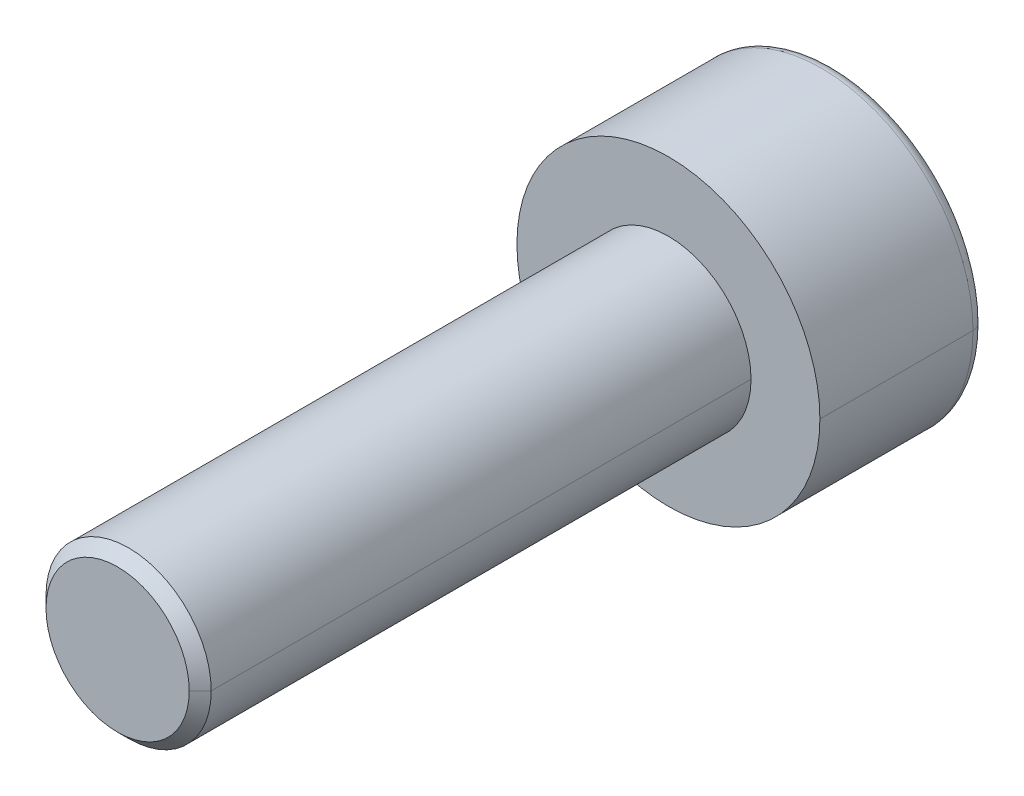
ISO-10303-21;
HEADER;
FILE_DESCRIPTION(('STEP AP214'),'2;1');
FILE_NAME('part.step','',(''),(''),'','','');
FILE_SCHEMA(('AUTOMOTIVE_DESIGN { 1 0 10303 214 1 1 1 1 }'));
ENDSEC;
DATA;
#1=APPLICATION_CONTEXT('core data for automotive mechanical design processes');
#2=APPLICATION_PROTOCOL_DEFINITION('international standard','automotive_design',2000,#1);
#3=PRODUCT_CONTEXT('',#1,'mechanical');
#4=PRODUCT('Part','Part','',(#3));
#5=PRODUCT_RELATED_PRODUCT_CATEGORY('part','',(#4));
#6=PRODUCT_DEFINITION_FORMATION('','',#4);
#7=PRODUCT_DEFINITION_CONTEXT('part definition',#1,'design');
#8=PRODUCT_DEFINITION('design','',#6,#7);
#9=PRODUCT_DEFINITION_SHAPE('','',#8);
#10=(LENGTH_UNIT() NAMED_UNIT(*) SI_UNIT(.MILLI.,.METRE.));
#11=(NAMED_UNIT(*) PLANE_ANGLE_UNIT() SI_UNIT($,.RADIAN.));
#12=(NAMED_UNIT(*) SI_UNIT($,.STERADIAN.) SOLID_ANGLE_UNIT());
#13=UNCERTAINTY_MEASURE_WITH_UNIT(LENGTH_MEASURE(1.E-05),#10,'distance_accuracy_value','');
#14=(GEOMETRIC_REPRESENTATION_CONTEXT(3) GLOBAL_UNCERTAINTY_ASSIGNED_CONTEXT((#13)) GLOBAL_UNIT_ASSIGNED_CONTEXT((#10,
#11,#12)) REPRESENTATION_CONTEXT('',''));
#15=CARTESIAN_POINT('',(0.,0.,0.));
#16=DIRECTION('',(0.,0.,1.));
#17=DIRECTION('',(1.,0.,0.));
#18=AXIS2_PLACEMENT_3D('',#15,#16,#17);
#19=CARTESIAN_POINT('',(0.,0.,-2.78));
#20=DIRECTION('',(0.,0.,-1.));
#21=DIRECTION('',(-1.,0.,0.));
#22=AXIS2_PLACEMENT_3D('',#19,#20,#21);
#23=TOROIDAL_SURFACE('',#22,2.53,0.22);
#24=CARTESIAN_POINT('',(2.53,0.,-2.78));
#25=DIRECTION('',(0.,1.,0.));
#26=DIRECTION('',(-1.,0.,0.));
#27=AXIS2_PLACEMENT_3D('',#24,#25,#26);
#28=CIRCLE('',#27,0.22);
#29=CARTESIAN_POINT('',(2.75,0.,-2.78));
#30=VERTEX_POINT('',#29);
#31=CARTESIAN_POINT('',(2.53,0.,-3.));
#32=VERTEX_POINT('',#31);
#33=EDGE_CURVE('E347',#30,#32,#28,.T.);
#34=ORIENTED_EDGE('',*,*,#33,.F.);
#35=CARTESIAN_POINT('',(0.,0.,-2.78));
#36=DIRECTION('',(0.,0.,1.));
#37=DIRECTION('',(-1.,0.,0.));
#38=AXIS2_PLACEMENT_3D('',#35,#36,#37);
#39=CIRCLE('',#38,2.75);
#40=CARTESIAN_POINT('',(-2.75,0.,-2.78));
#41=VERTEX_POINT('',#40);
#42=EDGE_CURVE('E338',#41,#30,#39,.T.);
#43=ORIENTED_EDGE('',*,*,#42,.F.);
#44=CARTESIAN_POINT('',(-2.53,0.,-2.78));
#45=DIRECTION('',(0.,-1.,0.));
#46=DIRECTION('',(0.,0.,-1.));
#47=AXIS2_PLACEMENT_3D('',#44,#45,#46);
#48=CIRCLE('',#47,0.22);
#49=CARTESIAN_POINT('',(-2.53,0.,-3.));
#50=VERTEX_POINT('',#49);
#51=EDGE_CURVE('E283',#41,#50,#48,.T.);
#52=ORIENTED_EDGE('',*,*,#51,.T.);
#53=CARTESIAN_POINT('',(0.,0.,-3.));
#54=DIRECTION('',(0.,0.,-1.));
#55=DIRECTION('',(-1.,0.,0.));
#56=AXIS2_PLACEMENT_3D('',#53,#54,#55);
#57=CIRCLE('',#56,2.53);
#58=EDGE_CURVE('E337',#32,#50,#57,.T.);
#59=ORIENTED_EDGE('',*,*,#58,.F.);
#60=EDGE_LOOP('',(#34,#43,#52,#59));
#61=FACE_BOUND('',#60,.T.);
#62=ADVANCED_FACE('F14',(#61),#23,.T.);
#63=CARTESIAN_POINT('',(-0.721687836487031,-1.25,10.001));
#64=DIRECTION('',(-0.866025403784438,-0.5,0.));
#65=DIRECTION('',(-0.5,0.866025403784438,0.));
#66=AXIS2_PLACEMENT_3D('',#63,#64,#65);
#67=PLANE('',#66);
#68=DIRECTION('',(0.,0.,-1.));
#69=VECTOR('',#68,1.);
#70=CARTESIAN_POINT('',(-0.721687836487031,-1.25,10.001));
#71=LINE('',#70,#69);
#72=CARTESIAN_POINT('',(-0.721687836487032,-1.25,-1.02534578182651));
#73=VERTEX_POINT('',#72);
#74=CARTESIAN_POINT('',(-0.721687836487031,-1.25,-3.));
#75=VERTEX_POINT('',#74);
#76=EDGE_CURVE('E9',#73,#75,#71,.T.);
#77=ORIENTED_EDGE('',*,*,#76,.T.);
#78=DIRECTION('',(-0.5,0.866025403784438,0.));
#79=VECTOR('',#78,1.);
#80=CARTESIAN_POINT('',(-0.721687836487031,-1.25,-3.));
#81=LINE('',#80,#79);
#82=CARTESIAN_POINT('',(-1.44337567297406,0.,-3.));
#83=VERTEX_POINT('',#82);
#84=EDGE_CURVE('E383',#75,#83,#81,.T.);
#85=ORIENTED_EDGE('',*,*,#84,.T.);
#86=DIRECTION('',(0.,0.,-1.));
#87=VECTOR('',#86,1.);
#88=CARTESIAN_POINT('',(-1.44337567297406,0.,10.001));
#89=LINE('',#88,#87);
#90=CARTESIAN_POINT('',(-1.44337567297406,0.,-1.02534578182651));
#91=VERTEX_POINT('',#90);
#92=EDGE_CURVE('E247',#91,#83,#89,.T.);
#93=ORIENTED_EDGE('',*,*,#92,.F.);
#94=CARTESIAN_POINT('',(-0.721687836488628,-1.25000000000276,-1.02534578182689));
#95=CARTESIAN_POINT('',(-0.737028905717831,-1.22342490729214,-1.01976117551291));
#96=CARTESIAN_POINT('',(-0.752392752544005,-1.19680749133607,-1.01443399416995));
#97=CARTESIAN_POINT('',(-0.78285146701696,-1.14404697766101,-1.00445997520597));
#98=CARTESIAN_POINT('',(-0.797945293580644,-1.11790551079034,-0.999801305045797));
#99=CARTESIAN_POINT('',(-0.827945381944215,-1.06596855728888,-0.991162467800491));
#100=CARTESIAN_POINT('',(-0.842850800425723,-1.04017419454268,-0.987172672666928));
#101=CARTESIAN_POINT('',(-0.87255671333803,-0.988781421927034,-0.979871222238988));
#102=CARTESIAN_POINT('',(-0.887356747658947,-0.963183663124447,-0.976553126739032));
#103=CARTESIAN_POINT('',(-0.917338190824219,-0.911236027906067,-0.97049521527339));
#104=CARTESIAN_POINT('',(-0.932519435239611,-0.884884013008228,-0.96777282238088));
#105=CARTESIAN_POINT('',(-0.962675714506317,-0.832539602040717,-0.963116776274453));
#106=CARTESIAN_POINT('',(-0.977650288499953,-0.806547979920624,-0.961171525572048));
#107=CARTESIAN_POINT('',(-1.00756607844125,-0.754698728350948,-0.958065927560992));
#108=CARTESIAN_POINT('',(-1.02250698803559,-0.728841191436054,-0.956901114579908));
#109=CARTESIAN_POINT('',(-1.05248357900316,-0.676993641155056,-0.955347814141439));
#110=CARTESIAN_POINT('',(-1.06751937330052,-0.651003582266423,-0.954963042805446));
#111=CARTESIAN_POINT('',(-1.09753796830446,-0.599007101351835,-0.954962542963305));
#112=CARTESIAN_POINT('',(-1.11252078824552,-0.5730006904358,-0.955346498559583));
#113=CARTESIAN_POINT('',(-1.1424254792955,-0.521130795636728,-0.956898723534234));
#114=CARTESIAN_POINT('',(-1.15734732390822,-0.495267191970626,-0.958063484033838));
#115=CARTESIAN_POINT('',(-1.18729435937359,-0.443436273258131,-0.961169177891923));
#116=CARTESIAN_POINT('',(-1.20231962659409,-0.417469284730215,-0.963114790934926));
#117=CARTESIAN_POINT('',(-1.23258152712783,-0.365166667551945,-0.967771543521245));
#118=CARTESIAN_POINT('',(-1.24781767835746,-0.338831818188706,-0.970494478844874));
#119=CARTESIAN_POINT('',(-1.27781558991929,-0.286886130729855,-0.976551997911192));
#120=CARTESIAN_POINT('',(-1.29257934454839,-0.26127435230088,-0.979868743297719));
#121=CARTESIAN_POINT('',(-1.32222852737226,-0.209858358317596,-0.987168466783736));
#122=CARTESIAN_POINT('',(-1.33711363698706,-0.184054887973093,-0.991157973283988));
#123=CARTESIAN_POINT('',(-1.36709323803795,-0.132106531907231,-0.999796871485574));
#124=CARTESIAN_POINT('',(-1.38218717849781,-0.105962953278782,-1.00445597673786));
#125=CARTESIAN_POINT('',(-1.41265514296032,-0.0531982255226708,-1.01443158402468));
#126=CARTESIAN_POINT('',(-1.42802826355574,-0.026578802412704,-1.01976000156966));
#127=CARTESIAN_POINT('',(-1.44337567297725,0.,-1.02534578182689));
#128=B_SPLINE_CURVE_WITH_KNOTS('',3,(#94,#95,#96,#97,#98,#99,#100,#101,#102,#103,#104,#105,#106,
#107,#108,#109,#110,#111,#112,#113,#114,#115,#116,#117,#118,#119,#120,#121,#122,#123,#124,#125,
#126,#127),.UNSPECIFIED.,.F.,.F.,(4,2,2,2,2,2,2,2,2,2,2,2,2,2,2,2,4),(0.,0.0935684862814182,
0.185193573801132,0.275358779576021,0.364613619727227,0.456206281143289,0.546375864607568,
0.636024987109074,0.726100204133781,0.81613841360598,0.905774686698935,0.995956373048592,
1.08758679344144,1.17682329674904,1.26698163449864,1.35861251377136,1.45220047471258),.UNSPECIFIED.);
#129=EDGE_CURVE('E149',#73,#91,#128,.T.);
#130=ORIENTED_EDGE('',*,*,#129,.F.);
#131=EDGE_LOOP('',(#77,#85,#93,#130));
#132=FACE_BOUND('',#131,.T.);
#133=ADVANCED_FACE('F198',(#132),#67,.F.);
#134=CARTESIAN_POINT('',(0.721687836487035,-1.25,10.001));
#135=DIRECTION('',(0.,-1.,0.));
#136=DIRECTION('',(0.,0.,-1.));
#137=AXIS2_PLACEMENT_3D('',#134,#135,#136);
#138=PLANE('',#137);
#139=DIRECTION('',(0.,0.,-1.));
#140=VECTOR('',#139,1.);
#141=CARTESIAN_POINT('',(0.721687836487035,-1.25,10.001));
#142=LINE('',#141,#140);
#143=CARTESIAN_POINT('',(0.721687836487035,-1.25,-1.02534578182651));
#144=VERTEX_POINT('',#143);
#145=CARTESIAN_POINT('',(0.721687836487035,-1.25,-3.));
#146=VERTEX_POINT('',#145);
#147=EDGE_CURVE('E28',#144,#146,#142,.T.);
#148=ORIENTED_EDGE('',*,*,#147,.T.);
#149=DIRECTION('',(-1.,0.,0.));
#150=VECTOR('',#149,1.);
#151=CARTESIAN_POINT('',(0.721687836487035,-1.25,-3.));
#152=LINE('',#151,#150);
#153=EDGE_CURVE('E388',#146,#75,#152,.T.);
#154=ORIENTED_EDGE('',*,*,#153,.T.);
#155=ORIENTED_EDGE('',*,*,#76,.F.);
#156=CARTESIAN_POINT('',(0.721687836488629,-1.25000000000276,-1.02534578182689));
#157=CARTESIAN_POINT('',(0.69106989522446,-1.24999821848567,-1.01977342261906));
#158=CARTESIAN_POINT('',(0.660404115850802,-1.24999523746448,-1.0144574364315));
#159=CARTESIAN_POINT('',(0.599614483094639,-1.24999366118821,-1.00450263885457));
#160=CARTESIAN_POINT('',(0.569492547467017,-1.24999497645064,-0.999852090531638));
#161=CARTESIAN_POINT('',(0.509639876543751,-1.25000804939325,-0.991226340753921));
#162=CARTESIAN_POINT('',(0.479910526091015,-1.25001964089534,-0.987241586492229));
#163=CARTESIAN_POINT('',(0.420673075610606,-1.2500497394438,-0.979947087981634));
#164=CARTESIAN_POINT('',(0.391165765094276,-1.25006817562219,-0.976630946044779));
#165=CARTESIAN_POINT('',(0.331241061966962,-1.25005916633512,-0.970566724830018));
#166=CARTESIAN_POINT('',(0.300821743064696,-1.2500303956143,-0.967837571691795));
#167=CARTESIAN_POINT('',(0.240399134076878,-1.24997380174712,-0.96316817933803));
#168=CARTESIAN_POINT('',(0.210396749868581,-1.24994597082088,-0.961216306373586));
#169=CARTESIAN_POINT('',(0.150526231254389,-1.24992842873486,-0.958097675193508));
#170=CARTESIAN_POINT('',(0.120658333381504,-1.24993849637725,-0.956926408006522));
#171=CARTESIAN_POINT('',(0.0607619538122846,-1.24997451013093,-0.95536034405441));
#172=CARTESIAN_POINT('',(0.0307333766028099,-1.25000053057617,-0.954969218958641));
#173=CARTESIAN_POINT('',(-0.0293692943147514,-1.2499994686253,-0.954956501715708));
#174=CARTESIAN_POINT('',(-0.0594433882894818,-1.24997230599032,-0.955336072371663));
#175=CARTESIAN_POINT('',(-0.119440155388413,-1.24993787968559,-0.956883291936376));
#176=CARTESIAN_POINT('',(-0.149362916869912,-1.24993052974767,-0.958047496601141));
#177=CARTESIAN_POINT('',(-0.209354932788893,-1.24995374775689,-0.961155699010819));
#178=CARTESIAN_POINT('',(-0.239423935435349,-1.2499845527295,-0.96310451998429));
#179=CARTESIAN_POINT('',(-0.299993961178023,-1.25004381840903,-0.967771201974227));
#180=CARTESIAN_POINT('',(-0.330494052906279,-1.25007223281607,-0.970501060282251));
#181=CARTESIAN_POINT('',(-0.390552271687982,-1.25007803265856,-0.976567284934808));
#182=CARTESIAN_POINT('',(-0.420112387925057,-1.25005685447466,-0.979884069240934));
#183=CARTESIAN_POINT('',(-0.479456429693424,-1.25002300837156,-0.987183082409129));
#184=CARTESIAN_POINT('',(-0.509239560811057,-1.25001042950366,-0.991171756617251));
#185=CARTESIAN_POINT('',(-0.569202101243196,-1.24999590387905,-0.999808168376348));
#186=CARTESIAN_POINT('',(-0.599380115468247,-1.24999413263484,-1.00446553457865));
#187=CARTESIAN_POINT('',(-0.660285332538211,-1.24999519744416,-1.0144368360125));
#188=CARTESIAN_POINT('',(-0.691010602252978,-1.24999813204998,-1.01976260529068));
#189=CARTESIAN_POINT('',(-0.721687836488628,-1.25000000000276,-1.02534578182689));
#190=B_SPLINE_CURVE_WITH_KNOTS('',3,(#156,#157,#158,#159,#160,#161,#162,#163,#164,#165,#166,
#167,#168,#169,#170,#171,#172,#173,#174,#175,#176,#177,#178,#179,#180,#181,#182,#183,#184,#185,
#186,#187,#188,#189),.UNSPECIFIED.,.F.,.F.,(4,2,2,2,2,2,2,2,2,2,2,2,2,2,2,2,4),(0.,
0.0933632628440702,0.184794465323455,0.274773558726806,0.363845895339632,0.455461829878775,
0.545649745829167,0.635312091665749,0.725395438931119,0.815614802298437,0.905440694405152,
0.995827411260518,1.08768483376141,1.17691477341478,1.26705528982293,1.35865584660163,
1.45219992963325),.UNSPECIFIED.);
#191=EDGE_CURVE('E141',#144,#73,#190,.T.);
#192=ORIENTED_EDGE('',*,*,#191,.F.);
#193=EDGE_LOOP('',(#148,#154,#155,#192));
#194=FACE_BOUND('',#193,.T.);
#195=ADVANCED_FACE('F143',(#194),#138,.F.);
#196=CARTESIAN_POINT('',(1.44337567297407,0.,10.001));
#197=DIRECTION('',(0.866025403784439,-0.5,0.));
#198=DIRECTION('',(0.,0.,-1.));
#199=AXIS2_PLACEMENT_3D('',#196,#197,#198);
#200=PLANE('',#199);
#201=DIRECTION('',(0.,0.,-1.));
#202=VECTOR('',#201,1.);
#203=CARTESIAN_POINT('',(1.44337567297407,0.,10.001));
#204=LINE('',#203,#202);
#205=CARTESIAN_POINT('',(1.44337567297407,0.,-1.02534578182651));
#206=VERTEX_POINT('',#205);
#207=CARTESIAN_POINT('',(1.44337567297407,0.,-3.));
#208=VERTEX_POINT('',#207);
#209=EDGE_CURVE('E138',#206,#208,#204,.T.);
#210=ORIENTED_EDGE('',*,*,#209,.T.);
#211=DIRECTION('',(-0.5,-0.866025403784439,0.));
#212=VECTOR('',#211,1.);
#213=CARTESIAN_POINT('',(1.44337567297407,0.,-3.));
#214=LINE('',#213,#212);
#215=EDGE_CURVE('E133',#208,#146,#214,.T.);
#216=ORIENTED_EDGE('',*,*,#215,.T.);
#217=ORIENTED_EDGE('',*,*,#147,.F.);
#218=CARTESIAN_POINT('',(1.44337567297725,0.,-1.02534578182689));
#219=CARTESIAN_POINT('',(1.42803150219652,-0.026573302028887,-1.01976117551291));
#220=CARTESIAN_POINT('',(1.41266206720855,-0.0531874916581321,-1.01443399416994));
#221=CARTESIAN_POINT('',(1.38219947928574,-0.105945768995711,-1.00445997520596));
#222=CARTESIAN_POINT('',(1.36710721816541,-0.132088139675484,-0.999801305045794));
#223=CARTESIAN_POINT('',(1.33712854121977,-0.184037455064854,-0.991162467800485));
#224=CARTESIAN_POINT('',(1.32224267704788,-0.209843107497014,-0.98717267266692));
#225=CARTESIAN_POINT('',(1.29258818684797,-0.261265569029666,-0.979871222238987));
#226=CARTESIAN_POINT('',(1.27781989460544,-0.286881654129879,-0.976553126739042));
#227=CARTESIAN_POINT('',(1.24782264442245,-0.338820163162294,-0.970495215273404));
#228=CARTESIAN_POINT('',(1.23259175228773,-0.365143513935858,-0.967772822380881));
#229=CARTESIAN_POINT('',(1.20233830227713,-0.417431823348022,-0.963116776274445));
#230=CARTESIAN_POINT('',(1.18731618423242,-0.443395995897376,-0.961171525572044));
#231=CARTESIAN_POINT('',(1.15737131017654,-0.49522845574567,-0.958065927560991));
#232=CARTESIAN_POINT('',(1.14244848112612,-0.52109643146751,-0.956901114579908));
#233=CARTESIAN_POINT('',(1.1125354809425,-0.572980695904942,-0.955347814141437));
#234=CARTESIAN_POINT('',(1.09754532684772,-0.598997105176963,-0.954963042805445));
#235=CARTESIAN_POINT('',(1.0675243509702,-0.650992211493703,-0.954962542963307));
#236=CARTESIAN_POINT('',(1.05249354842619,-0.676970919641005,-0.955346498559583));
#237=CARTESIAN_POINT('',(1.02252524736355,-0.728804089182149,-0.956898723534234));
#238=CARTESIAN_POINT('',(1.00758763186166,-0.754658587521139,-0.958063484033838));
#239=CARTESIAN_POINT('',(0.977674257287833,-0.80650894035843,-0.961169177891923));
#240=CARTESIAN_POINT('',(0.962698819173131,-0.832504697733997,-0.963114790934926));
#241=CARTESIAN_POINT('',(0.932534374279204,-0.884863580952144,-0.967771543521244));
#242=CARTESIAN_POINT('',(0.917345801340618,-0.911225899654526,-0.970494478844874));
#243=CARTESIAN_POINT('',(0.887358472165125,-0.963177696856981,-0.976551997911192));
#244=CARTESIAN_POINT('',(0.872559898724083,-0.988769372635505,-0.979868743297719));
#245=CARTESIAN_POINT('',(0.842856933185666,-1.04015431515407,-0.987168466783736));
#246=CARTESIAN_POINT('',(0.827953027168927,-1.06594693339085,-0.991157973283987));
#247=CARTESIAN_POINT('',(0.7979542316565,-1.11788420752918,-0.999796871485574));
#248=CARTESIAN_POINT('',(0.782860198648357,-1.14402773272485,-1.00445597673786));
#249=CARTESIAN_POINT('',(0.752398586219049,-1.19679612782903,-1.01443158402468));
#250=CARTESIAN_POINT('',(0.737032049869443,-1.22341935235509,-1.01976000156966));
#251=CARTESIAN_POINT('',(0.721687836488629,-1.25000000000276,-1.02534578182689));
#252=B_SPLINE_CURVE_WITH_KNOTS('',3,(#218,#219,#220,#221,#222,#223,#224,#225,#226,#227,#228,
#229,#230,#231,#232,#233,#234,#235,#236,#237,#238,#239,#240,#241,#242,#243,#244,#245,#246,#247,
#248,#249,#250,#251),.UNSPECIFIED.,.F.,.F.,(4,2,2,2,2,2,2,2,2,2,2,2,2,2,2,2,4),(0.,
0.0935684862811158,0.185193573800729,0.275358779575722,0.364613619727235,0.456206281142907,
0.546375864607052,0.636024987108686,0.726100204133779,0.816138413605981,0.905774686698939,
0.995956373048596,1.08758679344144,1.17682329674905,1.26698163449864,1.35861251377136,
1.45220047471258),.UNSPECIFIED.);
#253=EDGE_CURVE('E130',#206,#144,#252,.T.);
#254=ORIENTED_EDGE('',*,*,#253,.F.);
#255=EDGE_LOOP('',(#210,#216,#217,#254));
#256=FACE_BOUND('',#255,.T.);
#257=ADVANCED_FACE('F128',(#256),#200,.F.);
#258=CARTESIAN_POINT('',(0.721687836487032,1.25,10.001));
#259=DIRECTION('',(0.866025403784439,0.5,0.));
#260=DIRECTION('',(0.,0.,-1.));
#261=AXIS2_PLACEMENT_3D('',#258,#259,#260);
#262=PLANE('',#261);
#263=DIRECTION('',(0.,0.,-1.));
#264=VECTOR('',#263,1.);
#265=CARTESIAN_POINT('',(0.721687836487032,1.25,10.001));
#266=LINE('',#265,#264);
#267=CARTESIAN_POINT('',(0.721687836487032,1.25,-1.02534578182651));
#268=VERTEX_POINT('',#267);
#269=CARTESIAN_POINT('',(0.721687836487032,1.25,-3.));
#270=VERTEX_POINT('',#269);
#271=EDGE_CURVE('E43',#268,#270,#266,.T.);
#272=ORIENTED_EDGE('',*,*,#271,.T.);
#273=DIRECTION('',(0.5,-0.866025403784438,0.));
#274=VECTOR('',#273,1.);
#275=CARTESIAN_POINT('',(0.721687836487032,1.25,-3.));
#276=LINE('',#275,#274);
#277=EDGE_CURVE('E321',#270,#208,#276,.T.);
#278=ORIENTED_EDGE('',*,*,#277,.T.);
#279=ORIENTED_EDGE('',*,*,#209,.F.);
#280=CARTESIAN_POINT('',(0.721687836488626,1.25000000000276,-1.02534578182689));
#281=CARTESIAN_POINT('',(0.737028905717706,1.22342490729219,-1.01976117551291));
#282=CARTESIAN_POINT('',(0.752392752543788,1.19680749133618,-1.01443399416994));
#283=CARTESIAN_POINT('',(0.782851467016631,1.14404697766122,-1.00445997520596));
#284=CARTESIAN_POINT('',(0.797945293580297,1.11790551079058,-0.999801305045794));
#285=CARTESIAN_POINT('',(0.827945381943881,1.06596855728912,-0.991162467800485));
#286=CARTESIAN_POINT('',(0.842850800425421,1.0401741945429,-0.98717267266692));
#287=CARTESIAN_POINT('',(0.872556713337869,0.988781421927176,-0.979871222238987));
#288=CARTESIAN_POINT('',(0.887356747658896,0.963183663124531,-0.976553126739042));
#289=CARTESIAN_POINT('',(0.91733819082416,0.911236027906178,-0.970495215273404));
#290=CARTESIAN_POINT('',(0.932519435239431,0.88488401300842,-0.967772822380881));
#291=CARTESIAN_POINT('',(0.962675714506009,0.832539602041038,-0.963116776274445));
#292=CARTESIAN_POINT('',(0.977650288499635,0.80654797992099,-0.961171525572044));
#293=CARTESIAN_POINT('',(1.00756607844096,0.754698728351331,-0.958065927560992));
#294=CARTESIAN_POINT('',(1.02250698803534,0.72884119143641,-0.956901114579908));
#295=CARTESIAN_POINT('',(1.05248357900302,0.676993641155274,-0.955347814141437));
#296=CARTESIAN_POINT('',(1.06751937330045,0.651003582266533,-0.954963042805444));
#297=CARTESIAN_POINT('',(1.0975379683044,0.599007101351953,-0.954962542963308));
#298=CARTESIAN_POINT('',(1.1125207882454,0.573000690436034,-0.955346498559585));
#299=CARTESIAN_POINT('',(1.14242547929532,0.521130795637124,-0.956898723534234));
#300=CARTESIAN_POINT('',(1.15734732390803,0.495267191971068,-0.958063484033838));
#301=CARTESIAN_POINT('',(1.18729435937343,0.443436273258589,-0.961169177891927));
#302=CARTESIAN_POINT('',(1.20231962659397,0.417469284730643,-0.963114790934934));
#303=CARTESIAN_POINT('',(1.23258152712775,0.365166667552197,-0.967771543521243));
#304=CARTESIAN_POINT('',(1.24781767835739,0.338831818188813,-0.970494478844861));
#305=CARTESIAN_POINT('',(1.27781558991925,0.286886130729941,-0.976551997911182));
#306=CARTESIAN_POINT('',(1.29257934454835,0.261274352301088,-0.97986874329772));
#307=CARTESIAN_POINT('',(1.32222852737222,0.209858358317966,-0.987168466783744));
#308=CARTESIAN_POINT('',(1.33711363698702,0.184054887973501,-0.991157973283993));
#309=CARTESIAN_POINT('',(1.36709323803793,0.132106531907646,-0.999796871485578));
#310=CARTESIAN_POINT('',(1.3821871784978,0.105962953279166,-1.00445597673787));
#311=CARTESIAN_POINT('',(1.41265514296033,0.0531982255229139,-1.01443158402469));
#312=CARTESIAN_POINT('',(1.42802826355576,0.0265788024128361,-1.01976000156966));
#313=CARTESIAN_POINT('',(1.44337567297725,0.,-1.02534578182689));
#314=B_SPLINE_CURVE_WITH_KNOTS('',3,(#280,#281,#282,#283,#284,#285,#286,#287,#288,#289,#290,
#291,#292,#293,#294,#295,#296,#297,#298,#299,#300,#301,#302,#303,#304,#305,#306,#307,#308,#309,
#310,#311,#312,#313),.UNSPECIFIED.,.F.,.F.,(4,2,2,2,2,2,2,2,2,2,2,2,2,2,2,2,4),(0.,
0.0935684862811152,0.18519357380073,0.275358779575722,0.364613619727236,0.456206281142908,
0.546375864607054,0.63602498710869,0.726100204133785,0.816138413605596,0.905774686698423,
0.995956373048211,1.08758679344145,1.17682329674875,1.26698163449824,1.35861251377106,
1.45220047471258),.UNSPECIFIED.);
#315=EDGE_CURVE('E277',#268,#206,#314,.T.);
#316=ORIENTED_EDGE('',*,*,#315,.F.);
#317=EDGE_LOOP('',(#272,#278,#279,#316));
#318=FACE_BOUND('',#317,.T.);
#319=ADVANCED_FACE('F209',(#318),#262,.F.);
#320=CARTESIAN_POINT('',(-0.721687836487032,1.25,10.001));
#321=DIRECTION('',(0.,1.,0.));
#322=DIRECTION('',(1.,0.,0.));
#323=AXIS2_PLACEMENT_3D('',#320,#321,#322);
#324=PLANE('',#323);
#325=DIRECTION('',(0.,0.,-1.));
#326=VECTOR('',#325,1.);
#327=CARTESIAN_POINT('',(-0.721687836487032,1.25,10.001));
#328=LINE('',#327,#326);
#329=CARTESIAN_POINT('',(-0.721687836487032,1.25,-1.02534578182651));
#330=VERTEX_POINT('',#329);
#331=CARTESIAN_POINT('',(-0.721687836487032,1.25,-3.));
#332=VERTEX_POINT('',#331);
#333=EDGE_CURVE('E238',#330,#332,#328,.T.);
#334=ORIENTED_EDGE('',*,*,#333,.T.);
#335=DIRECTION('',(1.,0.,0.));
#336=VECTOR('',#335,1.);
#337=CARTESIAN_POINT('',(-0.721687836487032,1.25,-3.));
#338=LINE('',#337,#336);
#339=EDGE_CURVE('E315',#332,#270,#338,.T.);
#340=ORIENTED_EDGE('',*,*,#339,.T.);
#341=ORIENTED_EDGE('',*,*,#271,.F.);
#342=CARTESIAN_POINT('',(-0.721687836488627,1.25000000000276,-1.02534578182689));
#343=CARTESIAN_POINT('',(-0.691017018601996,1.24999818698242,-1.01976378543812));
#344=CARTESIAN_POINT('',(-0.660298157594406,1.2499958302246,-1.01443925883621));
#345=CARTESIAN_POINT('',(-0.599401258719088,1.2499962033096,-1.00446955406069));
#346=CARTESIAN_POINT('',(-0.569225140327368,1.2499988291996,-0.999812625256782));
#347=CARTESIAN_POINT('',(-0.50926222938833,1.25001464102119,-0.991176274700509));
#348=CARTESIAN_POINT('',(-0.479476819379824,1.25002765943499,-0.987187310214842));
#349=CARTESIAN_POINT('',(-0.420124479236322,1.25006013698098,-0.979886561271186));
#350=CARTESIAN_POINT('',(-0.390558332708806,1.25007953058455,-0.976568419996489));
#351=CARTESIAN_POINT('',(-0.330506688883164,1.25007069355756,-0.970501798660996));
#352=CARTESIAN_POINT('',(-0.300019244295399,1.25004107484861,-0.967772483513778));
#353=CARTESIAN_POINT('',(-0.239465913128966,1.24998197389594,-0.963106509003777));
#354=CARTESIAN_POINT('',(-0.209400942601997,1.24995249683952,-0.961158051806058));
#355=CARTESIAN_POINT('',(-0.149408671403001,1.2499319393902,-0.958049945837115));
#356=CARTESIAN_POINT('',(-0.119481611177984,1.2499406324116,-0.956885689357264));
#357=CARTESIAN_POINT('',(-0.0594681667187558,1.24997504904478,-0.955337390925111));
#358=CARTESIAN_POINT('',(-0.0293816887161701,1.25000085165947,-0.954957002080744));
#359=CARTESIAN_POINT('',(0.0307209998153106,1.24999915032776,-0.954968714524349));
#360=CARTESIAN_POINT('',(0.060737210707922,1.24997177046308,-0.955359017721788));
#361=CARTESIAN_POINT('',(0.12061693597785,1.24993574279334,-0.956923998252151));
#362=CARTESIAN_POINT('',(0.150480540408343,1.24992701298175,-0.958095211859228));
#363=CARTESIAN_POINT('',(0.210350803002745,1.2499472067504,-0.96121393927303));
#364=CARTESIAN_POINT('',(0.240357213275473,1.24997636191827,-0.963166176754469));
#365=CARTESIAN_POINT('',(0.300796493823954,1.25003312337082,-0.967836282271108));
#366=CARTESIAN_POINT('',(0.331228442901647,1.2500606971186,-0.970565982940798));
#367=CARTESIAN_POINT('',(0.391159720329838,1.25006668550964,-0.976629814383589));
#368=CARTESIAN_POINT('',(0.420661016792955,1.25004647242232,-0.979944603350857));
#369=CARTESIAN_POINT('',(0.479890191792365,1.25001501101687,-0.987237371130753));
#370=CARTESIAN_POINT('',(0.509617270040245,1.25000385728579,-0.991221835824491));
#371=CARTESIAN_POINT('',(0.569469572234333,1.24999206475649,-0.999847646580265));
#372=CARTESIAN_POINT('',(0.599593398840473,1.24999160010393,-1.00449863094455));
#373=CARTESIAN_POINT('',(0.660391326841129,1.24999460764868,-1.01445502060192));
#374=CARTESIAN_POINT('',(0.691063496895487,1.24999816383236,-1.01977224580446));
#375=CARTESIAN_POINT('',(0.721687836488626,1.25000000000276,-1.02534578182689));
#376=B_SPLINE_CURVE_WITH_KNOTS('',3,(#342,#343,#344,#345,#346,#347,#348,#349,#350,#351,#352,
#353,#354,#355,#356,#357,#358,#359,#360,#361,#362,#363,#364,#365,#366,#367,#368,#369,#370,#371,
#372,#373,#374,#375),.UNSPECIFIED.,.F.,.F.,(4,2,2,2,2,2,2,2,2,2,2,2,2,2,2,2,4),(0.,
0.0935245058897693,0.185119240206933,0.275266660694656,0.364515034078324,0.456334519766014,
0.546709076713369,0.636547878726234,0.726804423927812,0.816850641678475,0.906500093332328,
0.996700150967216,1.08835397262889,1.17740792477315,1.26738013439164,1.3588171444463,
1.45219992935346),.UNSPECIFIED.);
#377=EDGE_CURVE('E301',#330,#268,#376,.T.);
#378=ORIENTED_EDGE('',*,*,#377,.F.);
#379=EDGE_LOOP('',(#334,#340,#341,#378));
#380=FACE_BOUND('',#379,.T.);
#381=ADVANCED_FACE('F221',(#380),#324,.F.);
#382=CARTESIAN_POINT('',(-1.44337567297406,0.,10.001));
#383=DIRECTION('',(-0.866025403784439,0.5,0.));
#384=DIRECTION('',(0.,0.,1.));
#385=AXIS2_PLACEMENT_3D('',#382,#383,#384);
#386=PLANE('',#385);
#387=ORIENTED_EDGE('',*,*,#92,.T.);
#388=DIRECTION('',(0.5,0.866025403784439,0.));
#389=VECTOR('',#388,1.);
#390=CARTESIAN_POINT('',(-1.44337567297406,0.,-3.));
#391=LINE('',#390,#389);
#392=EDGE_CURVE('E379',#83,#332,#391,.T.);
#393=ORIENTED_EDGE('',*,*,#392,.T.);
#394=ORIENTED_EDGE('',*,*,#333,.F.);
#395=CARTESIAN_POINT('',(-1.44337567297725,0.,-1.02534578182689));
#396=CARTESIAN_POINT('',(-1.42803150219651,0.0265733020288515,-1.0197611755129));
#397=CARTESIAN_POINT('',(-1.41266206720855,0.0531874916580688,-1.01443399416994));
#398=CARTESIAN_POINT('',(-1.38219947928575,0.105945768995613,-1.00445997520596));
#399=CARTESIAN_POINT('',(-1.36710721816541,0.132088139675378,-0.999801305045793));
#400=CARTESIAN_POINT('',(-1.33712854121978,0.18403745506475,-0.991162467800483));
#401=CARTESIAN_POINT('',(-1.32224267704789,0.20984310749692,-0.987172672666918));
#402=CARTESIAN_POINT('',(-1.29258818684798,0.261265569029612,-0.979871222238987));
#403=CARTESIAN_POINT('',(-1.27781989460546,0.286881654129855,-0.976553126739044));
#404=CARTESIAN_POINT('',(-1.24782264442247,0.338820163162264,-0.970495215273407));
#405=CARTESIAN_POINT('',(-1.23259175228775,0.365143513935792,-0.967772822380882));
#406=CARTESIAN_POINT('',(-1.20233830227716,0.417431823347915,-0.963116776274443));
#407=CARTESIAN_POINT('',(-1.18731618423246,0.443395995897262,-0.961171525572044));
#408=CARTESIAN_POINT('',(-1.15737131017659,0.49522845574556,-0.958065927560991));
#409=CARTESIAN_POINT('',(-1.14244848112616,0.521096431467412,-0.956901114579908));
#410=CARTESIAN_POINT('',(-1.11253548094253,0.572980695904885,-0.955347814141437));
#411=CARTESIAN_POINT('',(-1.09754532684773,0.598997105176936,-0.954963042805444));
#412=CARTESIAN_POINT('',(-1.06752435097022,0.650992211493678,-0.954962542963308));
#413=CARTESIAN_POINT('',(-1.05249354842622,0.676970919640953,-0.955346498559584));
#414=CARTESIAN_POINT('',(-1.02252524736361,0.728804089182063,-0.956898723534234));
#415=CARTESIAN_POINT('',(-1.00758763186173,0.754658587521045,-0.958063484033838));
#416=CARTESIAN_POINT('',(-0.977674257287911,0.80650894035834,-0.961169177891924));
#417=CARTESIAN_POINT('',(-0.962698819173207,0.832504697733918,-0.963114790934928));
#418=CARTESIAN_POINT('',(-0.932534374279248,0.884863580952097,-0.967771543521244));
#419=CARTESIAN_POINT('',(-0.917345801340632,0.911225899654499,-0.970494478844871));
#420=CARTESIAN_POINT('',(-0.887358472165137,0.96317769685696,-0.976551997911189));
#421=CARTESIAN_POINT('',(-0.872559898724121,0.988769372635471,-0.979868743297719));
#422=CARTESIAN_POINT('',(-0.84285693318574,1.04015431515401,-0.987168466783738));
#423=CARTESIAN_POINT('',(-0.827953027169009,1.06594693339079,-0.991157973283989));
#424=CARTESIAN_POINT('',(-0.797954231656584,1.11788420752912,-0.999796871485575));
#425=CARTESIAN_POINT('',(-0.782860198648436,1.1440277327248,-1.00445597673786));
#426=CARTESIAN_POINT('',(-0.752398586219101,1.19679612782901,-1.01443158402468));
#427=CARTESIAN_POINT('',(-0.737032049869471,1.22341935235508,-1.01976000156966));
#428=CARTESIAN_POINT('',(-0.721687836488627,1.25000000000276,-1.02534578182689));
#429=B_SPLINE_CURVE_WITH_KNOTS('',3,(#395,#396,#397,#398,#399,#400,#401,#402,#403,#404,#405,
#406,#407,#408,#409,#410,#411,#412,#413,#414,#415,#416,#417,#418,#419,#420,#421,#422,#423,#424,
#425,#426,#427,#428),.UNSPECIFIED.,.F.,.F.,(4,2,2,2,2,2,2,2,2,2,2,2,2,2,2,2,4),(0.,
0.0935684862810406,0.18519357380063,0.275358779575648,0.364613619727237,0.456206281142812,
0.546375864606927,0.636024987108594,0.726100204133785,0.81613841360589,0.905774686698815,
0.995956373048504,1.08758679344145,1.17682329674898,1.26698163449854,1.35861251377129,
1.45220047471258),.UNSPECIFIED.);
#430=EDGE_CURVE('E256',#91,#330,#429,.T.);
#431=ORIENTED_EDGE('',*,*,#430,.F.);
#432=EDGE_LOOP('',(#387,#393,#394,#431));
#433=FACE_BOUND('',#432,.T.);
#434=ADVANCED_FACE('F16',(#433),#386,.F.);
#435=CARTESIAN_POINT('',(0.,0.,-1000.5));
#436=DIRECTION('',(0.,0.,-1.));
#437=DIRECTION('',(-1.,0.,0.));
#438=AXIS2_PLACEMENT_3D('',#435,#436,#437);
#439=CONICAL_SURFACE('',#438,2747.47741945459,1.22173047639603);
#440=DIRECTION('',(0.939692620785907,0.,-0.342020143325672));
#441=VECTOR('',#440,1.);
#442=CARTESIAN_POINT('',(0.,0.,-0.5));
#443=LINE('',#442,#441);
#444=CARTESIAN_POINT('',(0.,0.,-0.5));
#445=VERTEX_POINT('',#444);
#446=EDGE_CURVE('E156',#445,#206,#443,.T.);
#447=ORIENTED_EDGE('',*,*,#446,.F.);
#448=DIRECTION('',(-0.939692620785907,0.,-0.342020143325672));
#449=VECTOR('',#448,1.);
#450=CARTESIAN_POINT('',(0.,0.,-0.5));
#451=LINE('',#450,#449);
#452=EDGE_CURVE('E280',#445,#91,#451,.T.);
#453=ORIENTED_EDGE('',*,*,#452,.T.);
#454=ORIENTED_EDGE('',*,*,#430,.T.);
#455=ORIENTED_EDGE('',*,*,#377,.T.);
#456=ORIENTED_EDGE('',*,*,#315,.T.);
#457=EDGE_LOOP('',(#447,#453,#454,#455,#456));
#458=FACE_BOUND('',#457,.T.);
#459=ADVANCED_FACE('F174',(#458),#439,.F.);
#460=CARTESIAN_POINT('',(0.,0.,0.));
#461=DIRECTION('',(0.,0.,-1.));
#462=DIRECTION('',(0.,-1.,0.));
#463=AXIS2_PLACEMENT_3D('',#460,#461,#462);
#464=PLANE('',#463);
#465=CARTESIAN_POINT('',(0.,0.,0.));
#466=DIRECTION('',(0.,0.,-1.));
#467=DIRECTION('',(-1.,0.,0.));
#468=AXIS2_PLACEMENT_3D('',#465,#466,#467);
#469=CIRCLE('',#468,1.5);
#470=CARTESIAN_POINT('',(-1.5,0.,0.));
#471=VERTEX_POINT('',#470);
#472=CARTESIAN_POINT('',(1.5,0.,0.));
#473=VERTEX_POINT('',#472);
#474=EDGE_CURVE('E355',#471,#473,#469,.T.);
#475=ORIENTED_EDGE('',*,*,#474,.T.);
#476=CARTESIAN_POINT('',(0.,0.,0.));
#477=DIRECTION('',(0.,0.,-1.));
#478=DIRECTION('',(-1.,0.,0.));
#479=AXIS2_PLACEMENT_3D('',#476,#477,#478);
#480=CIRCLE('',#479,1.5);
#481=EDGE_CURVE('E427',#473,#471,#480,.T.);
#482=ORIENTED_EDGE('',*,*,#481,.T.);
#483=EDGE_LOOP('',(#475,#482));
#484=FACE_BOUND('',#483,.T.);
#485=CARTESIAN_POINT('',(0.,0.,0.));
#486=DIRECTION('',(0.,0.,-1.));
#487=DIRECTION('',(-1.,0.,0.));
#488=AXIS2_PLACEMENT_3D('',#485,#486,#487);
#489=CIRCLE('',#488,2.75);
#490=CARTESIAN_POINT('',(2.75,0.,0.));
#491=VERTEX_POINT('',#490);
#492=CARTESIAN_POINT('',(-2.75,0.,0.));
#493=VERTEX_POINT('',#492);
#494=EDGE_CURVE('E334',#491,#493,#489,.T.);
#495=ORIENTED_EDGE('',*,*,#494,.F.);
#496=CARTESIAN_POINT('',(0.,0.,0.));
#497=DIRECTION('',(0.,0.,-1.));
#498=DIRECTION('',(-1.,0.,0.));
#499=AXIS2_PLACEMENT_3D('',#496,#497,#498);
#500=CIRCLE('',#499,2.75);
#501=EDGE_CURVE('E362',#493,#491,#500,.T.);
#502=ORIENTED_EDGE('',*,*,#501,.F.);
#503=EDGE_LOOP('',(#495,#502));
#504=FACE_BOUND('',#503,.T.);
#505=ADVANCED_FACE('F450',(#484,#504),#464,.F.);
#506=CARTESIAN_POINT('',(0.,0.,-3.));
#507=DIRECTION('',(0.,0.,-1.));
#508=DIRECTION('',(0.,-1.,0.));
#509=AXIS2_PLACEMENT_3D('',#506,#507,#508);
#510=PLANE('',#509);
#511=ORIENTED_EDGE('',*,*,#392,.F.);
#512=ORIENTED_EDGE('',*,*,#84,.F.);
#513=ORIENTED_EDGE('',*,*,#153,.F.);
#514=ORIENTED_EDGE('',*,*,#215,.F.);
#515=ORIENTED_EDGE('',*,*,#277,.F.);
#516=ORIENTED_EDGE('',*,*,#339,.F.);
#517=EDGE_LOOP('',(#511,#512,#513,#514,#515,#516));
#518=FACE_BOUND('',#517,.T.);
#519=CARTESIAN_POINT('',(0.,0.,-3.));
#520=DIRECTION('',(0.,0.,-1.));
#521=DIRECTION('',(-1.,0.,0.));
#522=AXIS2_PLACEMENT_3D('',#519,#520,#521);
#523=CIRCLE('',#522,2.53);
#524=EDGE_CURVE('E343',#50,#32,#523,.T.);
#525=ORIENTED_EDGE('',*,*,#524,.T.);
#526=ORIENTED_EDGE('',*,*,#58,.T.);
#527=EDGE_LOOP('',(#525,#526));
#528=FACE_BOUND('',#527,.T.);
#529=ADVANCED_FACE('F416',(#518,#528),#510,.T.);
#530=CARTESIAN_POINT('',(0.,0.,-3.));
#531=DIRECTION('',(0.,0.,1.));
#532=DIRECTION('',(1.,0.,0.));
#533=AXIS2_PLACEMENT_3D('',#530,#531,#532);
#534=CYLINDRICAL_SURFACE('',#533,2.75);
#535=DIRECTION('',(0.,0.,1.));
#536=VECTOR('',#535,1.);
#537=CARTESIAN_POINT('',(-2.75,0.,-3.));
#538=LINE('',#537,#536);
#539=EDGE_CURVE('E286',#41,#493,#538,.T.);
#540=ORIENTED_EDGE('',*,*,#539,.F.);
#541=ORIENTED_EDGE('',*,*,#42,.T.);
#542=DIRECTION('',(0.,0.,1.));
#543=VECTOR('',#542,1.);
#544=CARTESIAN_POINT('',(2.75,0.,-3.));
#545=LINE('',#544,#543);
#546=EDGE_CURVE('E366',#30,#491,#545,.T.);
#547=ORIENTED_EDGE('',*,*,#546,.T.);
#548=ORIENTED_EDGE('',*,*,#494,.T.);
#549=EDGE_LOOP('',(#540,#541,#547,#548));
#550=FACE_BOUND('',#549,.T.);
#551=ADVANCED_FACE('F445',(#550),#534,.T.);
#552=CARTESIAN_POINT('',(0.,0.,10.));
#553=DIRECTION('',(0.,0.,-1.));
#554=DIRECTION('',(-1.,0.,0.));
#555=AXIS2_PLACEMENT_3D('',#552,#553,#554);
#556=CONICAL_SURFACE('',#555,1.3,0.785398163397449);
#557=DIRECTION('',(0.707106781186548,0.,-0.707106781186547));
#558=VECTOR('',#557,1.);
#559=CARTESIAN_POINT('',(1.3,0.,10.));
#560=LINE('',#559,#558);
#561=CARTESIAN_POINT('',(1.3,0.,10.));
#562=VERTEX_POINT('',#561);
#563=CARTESIAN_POINT('',(1.5,0.,9.8));
#564=VERTEX_POINT('',#563);
#565=EDGE_CURVE('E367',#562,#564,#560,.T.);
#566=ORIENTED_EDGE('',*,*,#565,.F.);
#567=CARTESIAN_POINT('',(0.,0.,10.));
#568=DIRECTION('',(0.,0.,1.));
#569=DIRECTION('',(1.,0.,0.));
#570=AXIS2_PLACEMENT_3D('',#567,#568,#569);
#571=CIRCLE('',#570,1.3);
#572=CARTESIAN_POINT('',(-1.3,0.,10.));
#573=VERTEX_POINT('',#572);
#574=EDGE_CURVE('E342',#573,#562,#571,.T.);
#575=ORIENTED_EDGE('',*,*,#574,.F.);
#576=DIRECTION('',(-0.707106781186548,0.,-0.707106781186547));
#577=VECTOR('',#576,1.);
#578=CARTESIAN_POINT('',(-1.3,0.,10.));
#579=LINE('',#578,#577);
#580=CARTESIAN_POINT('',(-1.5,0.,9.8));
#581=VERTEX_POINT('',#580);
#582=EDGE_CURVE('E356',#573,#581,#579,.T.);
#583=ORIENTED_EDGE('',*,*,#582,.T.);
#584=CARTESIAN_POINT('',(0.,0.,9.8));
#585=DIRECTION('',(0.,0.,-1.));
#586=DIRECTION('',(1.,0.,0.));
#587=AXIS2_PLACEMENT_3D('',#584,#585,#586);
#588=CIRCLE('',#587,1.5);
#589=EDGE_CURVE('E361',#564,#581,#588,.T.);
#590=ORIENTED_EDGE('',*,*,#589,.F.);
#591=EDGE_LOOP('',(#566,#575,#583,#590));
#592=FACE_BOUND('',#591,.T.);
#593=ADVANCED_FACE('F625',(#592),#556,.T.);
#594=CARTESIAN_POINT('',(0.,0.,10.));
#595=DIRECTION('',(0.,0.,1.));
#596=DIRECTION('',(1.,0.,0.));
#597=AXIS2_PLACEMENT_3D('',#594,#595,#596);
#598=PLANE('',#597);
#599=ORIENTED_EDGE('',*,*,#574,.T.);
#600=CARTESIAN_POINT('',(0.,0.,10.));
#601=DIRECTION('',(0.,0.,1.));
#602=DIRECTION('',(1.,0.,0.));
#603=AXIS2_PLACEMENT_3D('',#600,#601,#602);
#604=CIRCLE('',#603,1.3);
#605=EDGE_CURVE('E371',#562,#573,#604,.T.);
#606=ORIENTED_EDGE('',*,*,#605,.T.);
#607=EDGE_LOOP('',(#599,#606));
#608=FACE_BOUND('',#607,.T.);
#609=ADVANCED_FACE('F216',(#608),#598,.T.);
#610=CARTESIAN_POINT('',(0.,0.,10.));
#611=DIRECTION('',(0.,0.,-1.));
#612=DIRECTION('',(-1.,0.,0.));
#613=AXIS2_PLACEMENT_3D('',#610,#611,#612);
#614=CYLINDRICAL_SURFACE('',#613,1.5);
#615=DIRECTION('',(0.,0.,-1.));
#616=VECTOR('',#615,1.);
#617=CARTESIAN_POINT('',(1.5,0.,10.));
#618=LINE('',#617,#616);
#619=EDGE_CURVE('E351',#564,#473,#618,.T.);
#620=ORIENTED_EDGE('',*,*,#619,.F.);
#621=ORIENTED_EDGE('',*,*,#589,.T.);
#622=DIRECTION('',(0.,0.,-1.));
#623=VECTOR('',#622,1.);
#624=CARTESIAN_POINT('',(-1.5,0.,10.));
#625=LINE('',#624,#623);
#626=EDGE_CURVE('E357',#581,#471,#625,.T.);
#627=ORIENTED_EDGE('',*,*,#626,.T.);
#628=ORIENTED_EDGE('',*,*,#481,.F.);
#629=EDGE_LOOP('',(#620,#621,#627,#628));
#630=FACE_BOUND('',#629,.T.);
#631=ADVANCED_FACE('F212',(#630),#614,.T.);
#632=CARTESIAN_POINT('',(0.,0.,10.));
#633=DIRECTION('',(0.,0.,-1.));
#634=DIRECTION('',(-1.,0.,0.));
#635=AXIS2_PLACEMENT_3D('',#632,#633,#634);
#636=CYLINDRICAL_SURFACE('',#635,1.5);
#637=CARTESIAN_POINT('',(0.,0.,9.8));
#638=DIRECTION('',(0.,0.,-1.));
#639=DIRECTION('',(1.,0.,0.));
#640=AXIS2_PLACEMENT_3D('',#637,#638,#639);
#641=CIRCLE('',#640,1.5);
#642=EDGE_CURVE('E332',#581,#564,#641,.T.);
#643=ORIENTED_EDGE('',*,*,#642,.T.);
#644=ORIENTED_EDGE('',*,*,#619,.T.);
#645=ORIENTED_EDGE('',*,*,#474,.F.);
#646=ORIENTED_EDGE('',*,*,#626,.F.);
#647=EDGE_LOOP('',(#643,#644,#645,#646));
#648=FACE_BOUND('',#647,.T.);
#649=ADVANCED_FACE('F215',(#648),#636,.T.);
#650=CARTESIAN_POINT('',(0.,0.,10.));
#651=DIRECTION('',(0.,0.,-1.));
#652=DIRECTION('',(-1.,0.,0.));
#653=AXIS2_PLACEMENT_3D('',#650,#651,#652);
#654=CONICAL_SURFACE('',#653,1.3,0.785398163397449);
#655=ORIENTED_EDGE('',*,*,#605,.F.);
#656=ORIENTED_EDGE('',*,*,#565,.T.);
#657=ORIENTED_EDGE('',*,*,#642,.F.);
#658=ORIENTED_EDGE('',*,*,#582,.F.);
#659=EDGE_LOOP('',(#655,#656,#657,#658));
#660=FACE_BOUND('',#659,.T.);
#661=ADVANCED_FACE('F177',(#660),#654,.T.);
#662=CARTESIAN_POINT('',(0.,0.,-3.));
#663=DIRECTION('',(0.,0.,1.));
#664=DIRECTION('',(1.,0.,0.));
#665=AXIS2_PLACEMENT_3D('',#662,#663,#664);
#666=CYLINDRICAL_SURFACE('',#665,2.75);
#667=CARTESIAN_POINT('',(0.,0.,-2.78));
#668=DIRECTION('',(0.,0.,1.));
#669=DIRECTION('',(-1.,0.,0.));
#670=AXIS2_PLACEMENT_3D('',#667,#668,#669);
#671=CIRCLE('',#670,2.75);
#672=EDGE_CURVE('E387',#30,#41,#671,.T.);
#673=ORIENTED_EDGE('',*,*,#672,.T.);
#674=ORIENTED_EDGE('',*,*,#539,.T.);
#675=ORIENTED_EDGE('',*,*,#501,.T.);
#676=ORIENTED_EDGE('',*,*,#546,.F.);
#677=EDGE_LOOP('',(#673,#674,#675,#676));
#678=FACE_BOUND('',#677,.T.);
#679=ADVANCED_FACE('F173',(#678),#666,.T.);
#680=CARTESIAN_POINT('',(0.,0.,-1000.5));
#681=DIRECTION('',(0.,0.,-1.));
#682=DIRECTION('',(-1.,0.,0.));
#683=AXIS2_PLACEMENT_3D('',#680,#681,#682);
#684=CONICAL_SURFACE('',#683,2747.47741945459,1.22173047639603);
#685=ORIENTED_EDGE('',*,*,#452,.F.);
#686=ORIENTED_EDGE('',*,*,#446,.T.);
#687=ORIENTED_EDGE('',*,*,#253,.T.);
#688=ORIENTED_EDGE('',*,*,#191,.T.);
#689=ORIENTED_EDGE('',*,*,#129,.T.);
#690=EDGE_LOOP('',(#685,#686,#687,#688,#689));
#691=FACE_BOUND('',#690,.T.);
#692=ADVANCED_FACE('F154',(#691),#684,.F.);
#693=CARTESIAN_POINT('',(0.,0.,-2.78));
#694=DIRECTION('',(0.,0.,-1.));
#695=DIRECTION('',(-1.,0.,0.));
#696=AXIS2_PLACEMENT_3D('',#693,#694,#695);
#697=TOROIDAL_SURFACE('',#696,2.53,0.22);
#698=ORIENTED_EDGE('',*,*,#672,.F.);
#699=ORIENTED_EDGE('',*,*,#33,.T.);
#700=ORIENTED_EDGE('',*,*,#524,.F.);
#701=ORIENTED_EDGE('',*,*,#51,.F.);
#702=EDGE_LOOP('',(#698,#699,#700,#701));
#703=FACE_BOUND('',#702,.T.);
#704=ADVANCED_FACE('F172',(#703),#697,.T.);
#705=CLOSED_SHELL('',(#62,#133,#195,#257,#319,#381,#434,#459,#505,#529,#551,#593,#609,#631,#649,
#661,#679,#692,#704));
#706=MANIFOLD_SOLID_BREP('B1',#705);
#707=ADVANCED_BREP_SHAPE_REPRESENTATION('',(#18,#706),#14);
#708=SHAPE_DEFINITION_REPRESENTATION(#9,#707);
ENDSEC;
END-ISO-10303-21;
